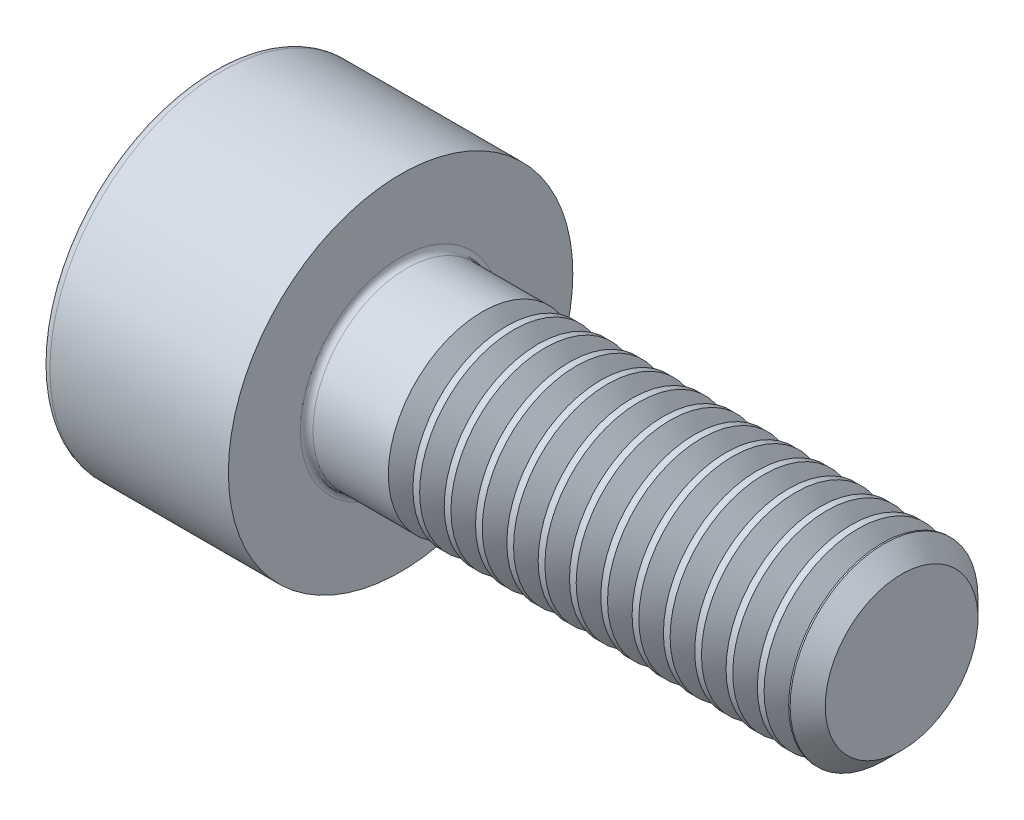
ISO-10303-21;
HEADER;
FILE_DESCRIPTION(('STEP AP214'),'2;1');
FILE_NAME('part.step','',(''),(''),'','','');
FILE_SCHEMA(('AUTOMOTIVE_DESIGN { 1 0 10303 214 1 1 1 1 }'));
ENDSEC;
DATA;
#1=APPLICATION_CONTEXT('core data for automotive mechanical design processes');
#2=APPLICATION_PROTOCOL_DEFINITION('international standard','automotive_design',2000,#1);
#3=PRODUCT_CONTEXT('',#1,'mechanical');
#4=PRODUCT('Part','Part','',(#3));
#5=PRODUCT_RELATED_PRODUCT_CATEGORY('part','',(#4));
#6=PRODUCT_DEFINITION_FORMATION('','',#4);
#7=PRODUCT_DEFINITION_CONTEXT('part definition',#1,'design');
#8=PRODUCT_DEFINITION('design','',#6,#7);
#9=PRODUCT_DEFINITION_SHAPE('','',#8);
#10=(LENGTH_UNIT() NAMED_UNIT(*) SI_UNIT(.MILLI.,.METRE.));
#11=(NAMED_UNIT(*) PLANE_ANGLE_UNIT() SI_UNIT($,.RADIAN.));
#12=(NAMED_UNIT(*) SI_UNIT($,.STERADIAN.) SOLID_ANGLE_UNIT());
#13=UNCERTAINTY_MEASURE_WITH_UNIT(LENGTH_MEASURE(1.E-05),#10,'distance_accuracy_value','');
#14=(GEOMETRIC_REPRESENTATION_CONTEXT(3) GLOBAL_UNCERTAINTY_ASSIGNED_CONTEXT((#13)) GLOBAL_UNIT_ASSIGNED_CONTEXT((#10,
#11,#12)) REPRESENTATION_CONTEXT('',''));
#15=CARTESIAN_POINT('',(0.,0.,0.));
#16=DIRECTION('',(0.,0.,1.));
#17=DIRECTION('',(1.,0.,0.));
#18=AXIS2_PLACEMENT_3D('',#15,#16,#17);
#19=CARTESIAN_POINT('',(0.,0.,0.));
#20=DIRECTION('',(-1.,0.,0.));
#21=DIRECTION('',(0.,0.,1.));
#22=AXIS2_PLACEMENT_3D('',#19,#20,#21);
#23=PLANE('',#22);
#24=DIRECTION('',(0.,-0.499999999999999,0.866025403784439));
#25=VECTOR('',#24,1.);
#26=CARTESIAN_POINT('',(0.,1.47801668912544,0.));
#27=LINE('',#26,#25);
#28=CARTESIAN_POINT('',(0.,1.47801668912544,0.));
#29=VERTEX_POINT('',#28);
#30=CARTESIAN_POINT('',(0.,0.73900834456272,1.28));
#31=VERTEX_POINT('',#30);
#32=EDGE_CURVE('E462',#29,#31,#27,.T.);
#33=ORIENTED_EDGE('',*,*,#32,.T.);
#34=DIRECTION('',(0.,1.,0.));
#35=VECTOR('',#34,1.);
#36=CARTESIAN_POINT('',(0.,-0.739008344562723,1.28));
#37=LINE('',#36,#35);
#38=CARTESIAN_POINT('',(0.,-0.739008344562723,1.28));
#39=VERTEX_POINT('',#38);
#40=EDGE_CURVE('E131',#39,#31,#37,.T.);
#41=ORIENTED_EDGE('',*,*,#40,.F.);
#42=DIRECTION('',(0.,-0.500000000000001,-0.866025403784438));
#43=VECTOR('',#42,1.);
#44=CARTESIAN_POINT('',(0.,-0.739008344562723,1.28));
#45=LINE('',#44,#43);
#46=CARTESIAN_POINT('',(0.,-1.47801668912545,0.));
#47=VERTEX_POINT('',#46);
#48=EDGE_CURVE('E481',#39,#47,#45,.T.);
#49=ORIENTED_EDGE('',*,*,#48,.T.);
#50=DIRECTION('',(0.,0.499999999999999,-0.866025403784439));
#51=VECTOR('',#50,1.);
#52=CARTESIAN_POINT('',(0.,-1.47801668912545,0.));
#53=LINE('',#52,#51);
#54=CARTESIAN_POINT('',(0.,-0.739008344562727,-1.28));
#55=VERTEX_POINT('',#54);
#56=EDGE_CURVE('E484',#47,#55,#53,.T.);
#57=ORIENTED_EDGE('',*,*,#56,.T.);
#58=DIRECTION('',(0.,-1.,0.));
#59=VECTOR('',#58,1.);
#60=CARTESIAN_POINT('',(0.,0.739008344562717,-1.28));
#61=LINE('',#60,#59);
#62=CARTESIAN_POINT('',(0.,0.739008344562717,-1.28));
#63=VERTEX_POINT('',#62);
#64=EDGE_CURVE('E487',#63,#55,#61,.T.);
#65=ORIENTED_EDGE('',*,*,#64,.F.);
#66=DIRECTION('',(0.,-0.500000000000001,-0.866025403784438));
#67=VECTOR('',#66,1.);
#68=CARTESIAN_POINT('',(0.,1.47801668912544,0.));
#69=LINE('',#68,#67);
#70=EDGE_CURVE('E126',#29,#63,#69,.T.);
#71=ORIENTED_EDGE('',*,*,#70,.F.);
#72=EDGE_LOOP('',(#33,#41,#49,#57,#65,#71));
#73=FACE_BOUND('',#72,.T.);
#74=CARTESIAN_POINT('',(0.,0.,0.));
#75=DIRECTION('',(-1.,0.,0.));
#76=DIRECTION('',(0.,0.,1.));
#77=AXIS2_PLACEMENT_3D('',#74,#75,#76);
#78=CIRCLE('',#77,2.6);
#79=CARTESIAN_POINT('',(0.,0.,2.6));
#80=VERTEX_POINT('',#79);
#81=EDGE_CURVE('E43',#80,#80,#78,.T.);
#82=ORIENTED_EDGE('',*,*,#81,.T.);
#83=EDGE_LOOP('',(#82));
#84=FACE_BOUND('',#83,.T.);
#85=ADVANCED_FACE('F35',(#73,#84),#23,.T.);
#86=CARTESIAN_POINT('',(-31.75,0.,0.));
#87=DIRECTION('',(-1.,0.,0.));
#88=DIRECTION('',(0.,0.,1.));
#89=AXIS2_PLACEMENT_3D('',#86,#87,#88);
#90=CYLINDRICAL_SURFACE('',#89,2.75);
#91=CARTESIAN_POINT('',(0.149999999999997,0.,0.));
#92=DIRECTION('',(-1.,0.,0.));
#93=DIRECTION('',(0.,0.,1.));
#94=AXIS2_PLACEMENT_3D('',#91,#92,#93);
#95=CIRCLE('',#94,2.75);
#96=CARTESIAN_POINT('',(0.149999999999997,0.,2.75));
#97=VERTEX_POINT('',#96);
#98=EDGE_CURVE('E11',#97,#97,#95,.F.);
#99=ORIENTED_EDGE('',*,*,#98,.T.);
#100=EDGE_LOOP('',(#99));
#101=FACE_BOUND('',#100,.T.);
#102=CARTESIAN_POINT('',(3.,0.,0.));
#103=DIRECTION('',(-1.,0.,0.));
#104=DIRECTION('',(0.,0.,1.));
#105=AXIS2_PLACEMENT_3D('',#102,#103,#104);
#106=CIRCLE('',#105,2.75);
#107=CARTESIAN_POINT('',(3.,0.,2.75));
#108=VERTEX_POINT('',#107);
#109=EDGE_CURVE('E149',#108,#108,#106,.T.);
#110=ORIENTED_EDGE('',*,*,#109,.T.);
#111=EDGE_LOOP('',(#110));
#112=FACE_BOUND('',#111,.T.);
#113=ADVANCED_FACE('F173',(#101,#112),#90,.T.);
#114=CARTESIAN_POINT('',(3.,2.75,0.));
#115=DIRECTION('',(1.,0.,0.));
#116=DIRECTION('',(0.,0.,-1.));
#117=AXIS2_PLACEMENT_3D('',#114,#115,#116);
#118=PLANE('',#117);
#119=CARTESIAN_POINT('',(3.,0.,0.));
#120=DIRECTION('',(1.,0.,0.));
#121=DIRECTION('',(0.,0.,-1.));
#122=AXIS2_PLACEMENT_3D('',#119,#120,#121);
#123=CIRCLE('',#122,1.59999999999997);
#124=CARTESIAN_POINT('',(3.,0.,-1.59999999999997));
#125=VERTEX_POINT('',#124);
#126=EDGE_CURVE('E152',#125,#125,#123,.F.);
#127=ORIENTED_EDGE('',*,*,#126,.T.);
#128=EDGE_LOOP('',(#127));
#129=FACE_BOUND('',#128,.T.);
#130=ORIENTED_EDGE('',*,*,#109,.F.);
#131=EDGE_LOOP('',(#130));
#132=FACE_BOUND('',#131,.T.);
#133=ADVANCED_FACE('F179',(#129,#132),#118,.T.);
#134=CARTESIAN_POINT('',(-31.75,0.,0.));
#135=DIRECTION('',(-1.,0.,0.));
#136=DIRECTION('',(0.,0.,1.));
#137=AXIS2_PLACEMENT_3D('',#134,#135,#136);
#138=CYLINDRICAL_SURFACE('',#137,1.49999999999997);
#139=CARTESIAN_POINT('',(4.30359178553217,0.,0.));
#140=DIRECTION('',(-1.,0.,0.));
#141=DIRECTION('',(0.,-1.,0.));
#142=AXIS2_PLACEMENT_3D('',#139,#140,#141);
#143=CIRCLE('',#142,1.5);
#144=CARTESIAN_POINT('',(4.30359178553217,-1.5,0.));
#145=VERTEX_POINT('',#144);
#146=EDGE_CURVE('E457',#145,#145,#143,.T.);
#147=ORIENTED_EDGE('',*,*,#146,.T.);
#148=EDGE_LOOP('',(#147));
#149=FACE_BOUND('',#148,.T.);
#150=CARTESIAN_POINT('',(3.1,0.,0.));
#151=DIRECTION('',(1.,0.,0.));
#152=DIRECTION('',(0.,0.,-1.));
#153=AXIS2_PLACEMENT_3D('',#150,#151,#152);
#154=CIRCLE('',#153,1.49999999999997);
#155=CARTESIAN_POINT('',(3.1,0.,-1.49999999999997));
#156=VERTEX_POINT('',#155);
#157=EDGE_CURVE('E155',#156,#156,#154,.T.);
#158=ORIENTED_EDGE('',*,*,#157,.T.);
#159=EDGE_LOOP('',(#158));
#160=FACE_BOUND('',#159,.T.);
#161=ADVANCED_FACE('F169',(#149,#160),#138,.T.);
#162=CARTESIAN_POINT('',(3.1,0.,0.));
#163=DIRECTION('',(1.,0.,0.));
#164=DIRECTION('',(0.,0.,-1.));
#165=AXIS2_PLACEMENT_3D('',#162,#163,#164);
#166=TOROIDAL_SURFACE('',#165,1.59999999999997,0.1);
#167=ORIENTED_EDGE('',*,*,#157,.F.);
#168=EDGE_LOOP('',(#167));
#169=FACE_BOUND('',#168,.T.);
#170=ORIENTED_EDGE('',*,*,#126,.F.);
#171=EDGE_LOOP('',(#170));
#172=FACE_BOUND('',#171,.T.);
#173=ADVANCED_FACE('F162',(#169,#172),#166,.F.);
#174=CARTESIAN_POINT('',(0.149999999999997,0.,0.));
#175=DIRECTION('',(-1.,0.,0.));
#176=DIRECTION('',(0.,0.,1.));
#177=AXIS2_PLACEMENT_3D('',#174,#175,#176);
#178=TOROIDAL_SURFACE('',#177,2.6,0.15);
#179=ORIENTED_EDGE('',*,*,#98,.F.);
#180=EDGE_LOOP('',(#179));
#181=FACE_BOUND('',#180,.T.);
#182=ORIENTED_EDGE('',*,*,#81,.F.);
#183=EDGE_LOOP('',(#182));
#184=FACE_BOUND('',#183,.T.);
#185=ADVANCED_FACE('F37',(#181,#184),#178,.T.);
#186=CARTESIAN_POINT('',(1.3,1.47801668912544,0.));
#187=DIRECTION('',(0.,-0.866025403784439,-0.499999999999999));
#188=DIRECTION('',(0.,0.499999999999999,-0.866025403784439));
#189=AXIS2_PLACEMENT_3D('',#186,#187,#188);
#190=PLANE('',#189);
#191=ORIENTED_EDGE('',*,*,#32,.F.);
#192=DIRECTION('',(-1.,0.,0.));
#193=VECTOR('',#192,1.);
#194=CARTESIAN_POINT('',(1.3,1.47801668912544,0.));
#195=LINE('',#194,#193);
#196=CARTESIAN_POINT('',(1.3,1.47801668912544,0.));
#197=VERTEX_POINT('',#196);
#198=EDGE_CURVE('E478',#197,#29,#195,.T.);
#199=ORIENTED_EDGE('',*,*,#198,.F.);
#200=DIRECTION('',(0.,-0.499999999999999,0.866025403784439));
#201=VECTOR('',#200,1.);
#202=CARTESIAN_POINT('',(1.3,1.47801668912544,0.));
#203=LINE('',#202,#201);
#204=CARTESIAN_POINT('',(1.3,1.10851251684408,0.639999999999997));
#205=VERTEX_POINT('',#204);
#206=EDGE_CURVE('E118',#197,#205,#203,.T.);
#207=ORIENTED_EDGE('',*,*,#206,.T.);
#208=CARTESIAN_POINT('',(1.3,0.73900834456272,1.28));
#209=VERTEX_POINT('',#208);
#210=EDGE_CURVE('E109',#205,#209,#203,.T.);
#211=ORIENTED_EDGE('',*,*,#210,.T.);
#212=DIRECTION('',(-1.,0.,0.));
#213=VECTOR('',#212,1.);
#214=CARTESIAN_POINT('',(1.3,0.73900834456272,1.28));
#215=LINE('',#214,#213);
#216=EDGE_CURVE('E123',#209,#31,#215,.T.);
#217=ORIENTED_EDGE('',*,*,#216,.T.);
#218=EDGE_LOOP('',(#191,#199,#207,#211,#217));
#219=FACE_BOUND('',#218,.T.);
#220=ADVANCED_FACE('F122',(#219),#190,.T.);
#221=CARTESIAN_POINT('',(1.3,-0.739008344562723,1.28));
#222=DIRECTION('',(0.,0.,1.));
#223=DIRECTION('',(0.,-1.,0.));
#224=AXIS2_PLACEMENT_3D('',#221,#222,#223);
#225=PLANE('',#224);
#226=ORIENTED_EDGE('',*,*,#40,.T.);
#227=ORIENTED_EDGE('',*,*,#216,.F.);
#228=DIRECTION('',(0.,1.,0.));
#229=VECTOR('',#228,1.);
#230=CARTESIAN_POINT('',(1.3,-0.739008344562723,1.28));
#231=LINE('',#230,#229);
#232=CARTESIAN_POINT('',(1.3,0.,1.28));
#233=VERTEX_POINT('',#232);
#234=EDGE_CURVE('E106',#233,#209,#231,.T.);
#235=ORIENTED_EDGE('',*,*,#234,.F.);
#236=CARTESIAN_POINT('',(1.3,-0.739008344562723,1.28));
#237=VERTEX_POINT('',#236);
#238=EDGE_CURVE('E117',#237,#233,#231,.T.);
#239=ORIENTED_EDGE('',*,*,#238,.F.);
#240=DIRECTION('',(-1.,0.,0.));
#241=VECTOR('',#240,1.);
#242=CARTESIAN_POINT('',(1.3,-0.739008344562723,1.28));
#243=LINE('',#242,#241);
#244=EDGE_CURVE('E133',#237,#39,#243,.T.);
#245=ORIENTED_EDGE('',*,*,#244,.T.);
#246=EDGE_LOOP('',(#226,#227,#235,#239,#245));
#247=FACE_BOUND('',#246,.T.);
#248=ADVANCED_FACE('F128',(#247),#225,.F.);
#249=CARTESIAN_POINT('',(1.3,-0.739008344562723,1.28));
#250=DIRECTION('',(0.,0.866025403784438,-0.500000000000001));
#251=DIRECTION('',(0.,0.500000000000001,0.866025403784438));
#252=AXIS2_PLACEMENT_3D('',#249,#250,#251);
#253=PLANE('',#252);
#254=ORIENTED_EDGE('',*,*,#48,.F.);
#255=ORIENTED_EDGE('',*,*,#244,.F.);
#256=DIRECTION('',(0.,-0.500000000000001,-0.866025403784438));
#257=VECTOR('',#256,1.);
#258=CARTESIAN_POINT('',(1.3,-0.739008344562723,1.28));
#259=LINE('',#258,#257);
#260=CARTESIAN_POINT('',(1.3,-1.10851251684408,0.640000000000002));
#261=VERTEX_POINT('',#260);
#262=EDGE_CURVE('E465',#237,#261,#259,.T.);
#263=ORIENTED_EDGE('',*,*,#262,.T.);
#264=CARTESIAN_POINT('',(1.3,-1.47801668912545,0.));
#265=VERTEX_POINT('',#264);
#266=EDGE_CURVE('E464',#261,#265,#259,.T.);
#267=ORIENTED_EDGE('',*,*,#266,.T.);
#268=DIRECTION('',(-1.,0.,0.));
#269=VECTOR('',#268,1.);
#270=CARTESIAN_POINT('',(1.3,-1.47801668912545,0.));
#271=LINE('',#270,#269);
#272=EDGE_CURVE('E138',#265,#47,#271,.T.);
#273=ORIENTED_EDGE('',*,*,#272,.T.);
#274=EDGE_LOOP('',(#254,#255,#263,#267,#273));
#275=FACE_BOUND('',#274,.T.);
#276=ADVANCED_FACE('F207',(#275),#253,.T.);
#277=CARTESIAN_POINT('',(1.3,-1.47801668912545,0.));
#278=DIRECTION('',(0.,0.866025403784439,0.499999999999999));
#279=DIRECTION('',(0.,-0.499999999999999,0.866025403784439));
#280=AXIS2_PLACEMENT_3D('',#277,#278,#279);
#281=PLANE('',#280);
#282=ORIENTED_EDGE('',*,*,#56,.F.);
#283=ORIENTED_EDGE('',*,*,#272,.F.);
#284=DIRECTION('',(0.,0.499999999999999,-0.866025403784439));
#285=VECTOR('',#284,1.);
#286=CARTESIAN_POINT('',(1.3,-1.47801668912545,0.));
#287=LINE('',#286,#285);
#288=CARTESIAN_POINT('',(1.3,-1.10851251684409,-0.640000000000001));
#289=VERTEX_POINT('',#288);
#290=EDGE_CURVE('E469',#265,#289,#287,.T.);
#291=ORIENTED_EDGE('',*,*,#290,.T.);
#292=CARTESIAN_POINT('',(1.3,-0.739008344562727,-1.28));
#293=VERTEX_POINT('',#292);
#294=EDGE_CURVE('E468',#289,#293,#287,.T.);
#295=ORIENTED_EDGE('',*,*,#294,.T.);
#296=DIRECTION('',(-1.,0.,0.));
#297=VECTOR('',#296,1.);
#298=CARTESIAN_POINT('',(1.3,-0.739008344562727,-1.28));
#299=LINE('',#298,#297);
#300=EDGE_CURVE('E496',#293,#55,#299,.T.);
#301=ORIENTED_EDGE('',*,*,#300,.T.);
#302=EDGE_LOOP('',(#282,#283,#291,#295,#301));
#303=FACE_BOUND('',#302,.T.);
#304=ADVANCED_FACE('F210',(#303),#281,.T.);
#305=CARTESIAN_POINT('',(1.3,0.739008344562717,-1.28));
#306=DIRECTION('',(0.,0.,-1.));
#307=DIRECTION('',(0.,1.,0.));
#308=AXIS2_PLACEMENT_3D('',#305,#306,#307);
#309=PLANE('',#308);
#310=ORIENTED_EDGE('',*,*,#64,.T.);
#311=ORIENTED_EDGE('',*,*,#300,.F.);
#312=DIRECTION('',(0.,-1.,0.));
#313=VECTOR('',#312,1.);
#314=CARTESIAN_POINT('',(1.3,0.739008344562717,-1.28));
#315=LINE('',#314,#313);
#316=CARTESIAN_POINT('',(1.3,0.,-1.28));
#317=VERTEX_POINT('',#316);
#318=EDGE_CURVE('E472',#317,#293,#315,.T.);
#319=ORIENTED_EDGE('',*,*,#318,.F.);
#320=CARTESIAN_POINT('',(1.3,0.739008344562717,-1.28));
#321=VERTEX_POINT('',#320);
#322=EDGE_CURVE('E50',#321,#317,#315,.T.);
#323=ORIENTED_EDGE('',*,*,#322,.F.);
#324=DIRECTION('',(-1.,0.,0.));
#325=VECTOR('',#324,1.);
#326=CARTESIAN_POINT('',(1.3,0.739008344562717,-1.28));
#327=LINE('',#326,#325);
#328=EDGE_CURVE('E493',#321,#63,#327,.T.);
#329=ORIENTED_EDGE('',*,*,#328,.T.);
#330=EDGE_LOOP('',(#310,#311,#319,#323,#329));
#331=FACE_BOUND('',#330,.T.);
#332=ADVANCED_FACE('F214',(#331),#309,.F.);
#333=CARTESIAN_POINT('',(1.3,1.47801668912544,0.));
#334=DIRECTION('',(0.,0.866025403784438,-0.500000000000001));
#335=DIRECTION('',(0.,0.500000000000001,0.866025403784438));
#336=AXIS2_PLACEMENT_3D('',#333,#334,#335);
#337=PLANE('',#336);
#338=ORIENTED_EDGE('',*,*,#70,.T.);
#339=ORIENTED_EDGE('',*,*,#328,.F.);
#340=DIRECTION('',(0.,-0.500000000000001,-0.866025403784438));
#341=VECTOR('',#340,1.);
#342=CARTESIAN_POINT('',(1.3,1.47801668912544,0.));
#343=LINE('',#342,#341);
#344=CARTESIAN_POINT('',(1.3,1.10851251684408,-0.640000000000001));
#345=VERTEX_POINT('',#344);
#346=EDGE_CURVE('E474',#345,#321,#343,.T.);
#347=ORIENTED_EDGE('',*,*,#346,.F.);
#348=EDGE_CURVE('E475',#197,#345,#343,.T.);
#349=ORIENTED_EDGE('',*,*,#348,.F.);
#350=ORIENTED_EDGE('',*,*,#198,.T.);
#351=EDGE_LOOP('',(#338,#339,#347,#349,#350));
#352=FACE_BOUND('',#351,.T.);
#353=ADVANCED_FACE('F218',(#352),#337,.F.);
#354=CARTESIAN_POINT('',(1.3,1.47801668912544,0.));
#355=DIRECTION('',(1.,0.,0.));
#356=DIRECTION('',(0.,0.,-1.));
#357=AXIS2_PLACEMENT_3D('',#354,#355,#356);
#358=PLANE('',#357);
#359=ORIENTED_EDGE('',*,*,#318,.T.);
#360=ORIENTED_EDGE('',*,*,#294,.F.);
#361=CARTESIAN_POINT('',(1.3,0.,0.));
#362=DIRECTION('',(-1.,0.,0.));
#363=DIRECTION('',(0.,0.,1.));
#364=AXIS2_PLACEMENT_3D('',#361,#362,#363);
#365=CIRCLE('',#364,1.28);
#366=EDGE_CURVE('E513',#317,#289,#365,.T.);
#367=ORIENTED_EDGE('',*,*,#366,.F.);
#368=EDGE_LOOP('',(#359,#360,#367));
#369=FACE_BOUND('',#368,.T.);
#370=ADVANCED_FACE('F222',(#369),#358,.F.);
#371=ORIENTED_EDGE('',*,*,#290,.F.);
#372=ORIENTED_EDGE('',*,*,#266,.F.);
#373=EDGE_CURVE('E136',#289,#261,#365,.T.);
#374=ORIENTED_EDGE('',*,*,#373,.F.);
#375=EDGE_LOOP('',(#371,#372,#374));
#376=FACE_BOUND('',#375,.T.);
#377=ADVANCED_FACE('F226',(#376),#358,.F.);
#378=ORIENTED_EDGE('',*,*,#262,.F.);
#379=ORIENTED_EDGE('',*,*,#238,.T.);
#380=EDGE_CURVE('E132',#261,#233,#365,.T.);
#381=ORIENTED_EDGE('',*,*,#380,.F.);
#382=EDGE_LOOP('',(#378,#379,#381));
#383=FACE_BOUND('',#382,.T.);
#384=ADVANCED_FACE('F522',(#383),#358,.F.);
#385=ORIENTED_EDGE('',*,*,#234,.T.);
#386=ORIENTED_EDGE('',*,*,#210,.F.);
#387=EDGE_CURVE('E112',#233,#205,#365,.T.);
#388=ORIENTED_EDGE('',*,*,#387,.F.);
#389=EDGE_LOOP('',(#385,#386,#388));
#390=FACE_BOUND('',#389,.T.);
#391=ADVANCED_FACE('F108',(#390),#358,.F.);
#392=ORIENTED_EDGE('',*,*,#206,.F.);
#393=ORIENTED_EDGE('',*,*,#348,.T.);
#394=EDGE_CURVE('E143',#205,#345,#365,.T.);
#395=ORIENTED_EDGE('',*,*,#394,.F.);
#396=EDGE_LOOP('',(#392,#393,#395));
#397=FACE_BOUND('',#396,.T.);
#398=ADVANCED_FACE('F508',(#397),#358,.F.);
#399=ORIENTED_EDGE('',*,*,#346,.T.);
#400=ORIENTED_EDGE('',*,*,#322,.T.);
#401=EDGE_CURVE('E512',#345,#317,#365,.T.);
#402=ORIENTED_EDGE('',*,*,#401,.F.);
#403=EDGE_LOOP('',(#399,#400,#402));
#404=FACE_BOUND('',#403,.T.);
#405=ADVANCED_FACE('F203',(#404),#358,.F.);
#406=CARTESIAN_POINT('',(1.3,0.,0.));
#407=DIRECTION('',(-1.,0.,0.));
#408=DIRECTION('',(0.,0.,1.));
#409=AXIS2_PLACEMENT_3D('',#406,#407,#408);
#410=CONICAL_SURFACE('',#409,1.28,1.04719755119659);
#411=CARTESIAN_POINT('',(2.03900834456273,0.,0.));
#412=VERTEX_POINT('',#411);
#413=VERTEX_LOOP('',#412);
#414=FACE_BOUND('',#413,.T.);
#415=ORIENTED_EDGE('',*,*,#387,.T.);
#416=ORIENTED_EDGE('',*,*,#394,.T.);
#417=ORIENTED_EDGE('',*,*,#401,.T.);
#418=ORIENTED_EDGE('',*,*,#366,.T.);
#419=ORIENTED_EDGE('',*,*,#373,.T.);
#420=ORIENTED_EDGE('',*,*,#380,.T.);
#421=EDGE_LOOP('',(#415,#416,#417,#418,#419,#420));
#422=FACE_BOUND('',#421,.T.);
#423=ADVANCED_FACE('F200',(#414,#422),#410,.F.);
#424=CARTESIAN_POINT('',(4.69640821446782,0.,0.));
#425=DIRECTION('',(1.,0.,0.));
#426=DIRECTION('',(0.,1.,0.));
#427=AXIS2_PLACEMENT_3D('',#424,#425,#426);
#428=CONICAL_SURFACE('',#427,1.5,0.959931088596882);
#429=CARTESIAN_POINT('',(4.5,0.,0.));
#430=DIRECTION('',(-1.,0.,0.));
#431=DIRECTION('',(0.,-1.,0.));
#432=AXIS2_PLACEMENT_3D('',#429,#430,#431);
#433=CIRCLE('',#432,1.2195);
#434=CARTESIAN_POINT('',(4.5,-1.2195,0.));
#435=VERTEX_POINT('',#434);
#436=EDGE_CURVE('E454',#435,#435,#433,.T.);
#437=ORIENTED_EDGE('',*,*,#436,.F.);
#438=EDGE_LOOP('',(#437));
#439=FACE_BOUND('',#438,.T.);
#440=CARTESIAN_POINT('',(4.69640821446782,0.,0.));
#441=DIRECTION('',(-1.,0.,0.));
#442=DIRECTION('',(0.,-1.,0.));
#443=AXIS2_PLACEMENT_3D('',#440,#441,#442);
#444=CIRCLE('',#443,1.5);
#445=CARTESIAN_POINT('',(4.69640821446782,-1.5,0.));
#446=VERTEX_POINT('',#445);
#447=EDGE_CURVE('E460',#446,#446,#444,.T.);
#448=ORIENTED_EDGE('',*,*,#447,.T.);
#449=EDGE_LOOP('',(#448));
#450=FACE_BOUND('',#449,.T.);
#451=ADVANCED_FACE('F202',(#439,#450),#428,.T.);
#452=CARTESIAN_POINT('',(4.5,0.,0.));
#453=DIRECTION('',(-1.,0.,0.));
#454=DIRECTION('',(0.,-1.,0.));
#455=AXIS2_PLACEMENT_3D('',#452,#453,#454);
#456=CONICAL_SURFACE('',#455,1.2195,0.959931088596876);
#457=ORIENTED_EDGE('',*,*,#146,.F.);
#458=EDGE_LOOP('',(#457));
#459=FACE_BOUND('',#458,.T.);
#460=ORIENTED_EDGE('',*,*,#436,.T.);
#461=EDGE_LOOP('',(#460));
#462=FACE_BOUND('',#461,.T.);
#463=ADVANCED_FACE('F230',(#459,#462),#456,.T.);
#464=CARTESIAN_POINT('',(4.80359178553217,0.,0.));
#465=DIRECTION('',(-1.,0.,0.));
#466=DIRECTION('',(0.,-1.,0.));
#467=AXIS2_PLACEMENT_3D('',#464,#465,#466);
#468=CIRCLE('',#467,1.5);
#469=CARTESIAN_POINT('',(4.80359178553217,-1.5,0.));
#470=VERTEX_POINT('',#469);
#471=EDGE_CURVE('E448',#470,#470,#468,.T.);
#472=ORIENTED_EDGE('',*,*,#471,.T.);
#473=EDGE_LOOP('',(#472));
#474=FACE_BOUND('',#473,.T.);
#475=ORIENTED_EDGE('',*,*,#447,.F.);
#476=EDGE_LOOP('',(#475));
#477=FACE_BOUND('',#476,.T.);
#478=ADVANCED_FACE('F190',(#474,#477),#138,.T.);
#479=CARTESIAN_POINT('',(5.19640821446782,0.,0.));
#480=DIRECTION('',(1.,0.,0.));
#481=DIRECTION('',(0.,1.,0.));
#482=AXIS2_PLACEMENT_3D('',#479,#480,#481);
#483=CONICAL_SURFACE('',#482,1.5,0.959931088596882);
#484=CARTESIAN_POINT('',(5.,0.,0.));
#485=DIRECTION('',(-1.,0.,0.));
#486=DIRECTION('',(0.,-1.,0.));
#487=AXIS2_PLACEMENT_3D('',#484,#485,#486);
#488=CIRCLE('',#487,1.2195);
#489=CARTESIAN_POINT('',(5.,-1.2195,0.));
#490=VERTEX_POINT('',#489);
#491=EDGE_CURVE('E445',#490,#490,#488,.T.);
#492=ORIENTED_EDGE('',*,*,#491,.F.);
#493=EDGE_LOOP('',(#492));
#494=FACE_BOUND('',#493,.T.);
#495=CARTESIAN_POINT('',(5.19640821446782,0.,0.));
#496=DIRECTION('',(-1.,0.,0.));
#497=DIRECTION('',(0.,-1.,0.));
#498=AXIS2_PLACEMENT_3D('',#495,#496,#497);
#499=CIRCLE('',#498,1.5);
#500=CARTESIAN_POINT('',(5.19640821446782,-1.5,0.));
#501=VERTEX_POINT('',#500);
#502=EDGE_CURVE('E451',#501,#501,#499,.T.);
#503=ORIENTED_EDGE('',*,*,#502,.T.);
#504=EDGE_LOOP('',(#503));
#505=FACE_BOUND('',#504,.T.);
#506=ADVANCED_FACE('F235',(#494,#505),#483,.T.);
#507=CARTESIAN_POINT('',(5.,0.,0.));
#508=DIRECTION('',(-1.,0.,0.));
#509=DIRECTION('',(0.,-1.,0.));
#510=AXIS2_PLACEMENT_3D('',#507,#508,#509);
#511=CONICAL_SURFACE('',#510,1.2195,0.959931088596876);
#512=ORIENTED_EDGE('',*,*,#471,.F.);
#513=EDGE_LOOP('',(#512));
#514=FACE_BOUND('',#513,.T.);
#515=ORIENTED_EDGE('',*,*,#491,.T.);
#516=EDGE_LOOP('',(#515));
#517=FACE_BOUND('',#516,.T.);
#518=ADVANCED_FACE('F238',(#514,#517),#511,.T.);
#519=CARTESIAN_POINT('',(5.30359178553217,0.,0.));
#520=DIRECTION('',(-1.,0.,0.));
#521=DIRECTION('',(0.,-1.,0.));
#522=AXIS2_PLACEMENT_3D('',#519,#520,#521);
#523=CIRCLE('',#522,1.5);
#524=CARTESIAN_POINT('',(5.30359178553217,-1.5,0.));
#525=VERTEX_POINT('',#524);
#526=EDGE_CURVE('E439',#525,#525,#523,.T.);
#527=ORIENTED_EDGE('',*,*,#526,.T.);
#528=EDGE_LOOP('',(#527));
#529=FACE_BOUND('',#528,.T.);
#530=ORIENTED_EDGE('',*,*,#502,.F.);
#531=EDGE_LOOP('',(#530));
#532=FACE_BOUND('',#531,.T.);
#533=ADVANCED_FACE('F242',(#529,#532),#138,.T.);
#534=CARTESIAN_POINT('',(5.69640821446782,0.,0.));
#535=DIRECTION('',(1.,0.,0.));
#536=DIRECTION('',(0.,1.,0.));
#537=AXIS2_PLACEMENT_3D('',#534,#535,#536);
#538=CONICAL_SURFACE('',#537,1.5,0.959931088596882);
#539=CARTESIAN_POINT('',(5.5,0.,0.));
#540=DIRECTION('',(-1.,0.,0.));
#541=DIRECTION('',(0.,-1.,0.));
#542=AXIS2_PLACEMENT_3D('',#539,#540,#541);
#543=CIRCLE('',#542,1.2195);
#544=CARTESIAN_POINT('',(5.5,-1.2195,0.));
#545=VERTEX_POINT('',#544);
#546=EDGE_CURVE('E436',#545,#545,#543,.T.);
#547=ORIENTED_EDGE('',*,*,#546,.F.);
#548=EDGE_LOOP('',(#547));
#549=FACE_BOUND('',#548,.T.);
#550=CARTESIAN_POINT('',(5.69640821446782,0.,0.));
#551=DIRECTION('',(-1.,0.,0.));
#552=DIRECTION('',(0.,-1.,0.));
#553=AXIS2_PLACEMENT_3D('',#550,#551,#552);
#554=CIRCLE('',#553,1.5);
#555=CARTESIAN_POINT('',(5.69640821446782,-1.5,0.));
#556=VERTEX_POINT('',#555);
#557=EDGE_CURVE('E442',#556,#556,#554,.T.);
#558=ORIENTED_EDGE('',*,*,#557,.T.);
#559=EDGE_LOOP('',(#558));
#560=FACE_BOUND('',#559,.T.);
#561=ADVANCED_FACE('F244',(#549,#560),#538,.T.);
#562=CARTESIAN_POINT('',(5.5,0.,0.));
#563=DIRECTION('',(-1.,0.,0.));
#564=DIRECTION('',(0.,-1.,0.));
#565=AXIS2_PLACEMENT_3D('',#562,#563,#564);
#566=CONICAL_SURFACE('',#565,1.2195,0.959931088596876);
#567=ORIENTED_EDGE('',*,*,#526,.F.);
#568=EDGE_LOOP('',(#567));
#569=FACE_BOUND('',#568,.T.);
#570=ORIENTED_EDGE('',*,*,#546,.T.);
#571=EDGE_LOOP('',(#570));
#572=FACE_BOUND('',#571,.T.);
#573=ADVANCED_FACE('F247',(#569,#572),#566,.T.);
#574=CARTESIAN_POINT('',(5.80359178553217,0.,0.));
#575=DIRECTION('',(-1.,0.,0.));
#576=DIRECTION('',(0.,-1.,0.));
#577=AXIS2_PLACEMENT_3D('',#574,#575,#576);
#578=CIRCLE('',#577,1.5);
#579=CARTESIAN_POINT('',(5.80359178553217,-1.5,0.));
#580=VERTEX_POINT('',#579);
#581=EDGE_CURVE('E430',#580,#580,#578,.T.);
#582=ORIENTED_EDGE('',*,*,#581,.T.);
#583=EDGE_LOOP('',(#582));
#584=FACE_BOUND('',#583,.T.);
#585=ORIENTED_EDGE('',*,*,#557,.F.);
#586=EDGE_LOOP('',(#585));
#587=FACE_BOUND('',#586,.T.);
#588=ADVANCED_FACE('F251',(#584,#587),#138,.T.);
#589=CARTESIAN_POINT('',(6.19640821446782,0.,0.));
#590=DIRECTION('',(1.,0.,0.));
#591=DIRECTION('',(0.,1.,0.));
#592=AXIS2_PLACEMENT_3D('',#589,#590,#591);
#593=CONICAL_SURFACE('',#592,1.5,0.959931088596882);
#594=CARTESIAN_POINT('',(6.,0.,0.));
#595=DIRECTION('',(-1.,0.,0.));
#596=DIRECTION('',(0.,-1.,0.));
#597=AXIS2_PLACEMENT_3D('',#594,#595,#596);
#598=CIRCLE('',#597,1.2195);
#599=CARTESIAN_POINT('',(6.,-1.2195,0.));
#600=VERTEX_POINT('',#599);
#601=EDGE_CURVE('E427',#600,#600,#598,.T.);
#602=ORIENTED_EDGE('',*,*,#601,.F.);
#603=EDGE_LOOP('',(#602));
#604=FACE_BOUND('',#603,.T.);
#605=CARTESIAN_POINT('',(6.19640821446782,0.,0.));
#606=DIRECTION('',(-1.,0.,0.));
#607=DIRECTION('',(0.,-1.,0.));
#608=AXIS2_PLACEMENT_3D('',#605,#606,#607);
#609=CIRCLE('',#608,1.5);
#610=CARTESIAN_POINT('',(6.19640821446782,-1.5,0.));
#611=VERTEX_POINT('',#610);
#612=EDGE_CURVE('E433',#611,#611,#609,.T.);
#613=ORIENTED_EDGE('',*,*,#612,.T.);
#614=EDGE_LOOP('',(#613));
#615=FACE_BOUND('',#614,.T.);
#616=ADVANCED_FACE('F253',(#604,#615),#593,.T.);
#617=CARTESIAN_POINT('',(6.,0.,0.));
#618=DIRECTION('',(-1.,0.,0.));
#619=DIRECTION('',(0.,-1.,0.));
#620=AXIS2_PLACEMENT_3D('',#617,#618,#619);
#621=CONICAL_SURFACE('',#620,1.2195,0.959931088596876);
#622=ORIENTED_EDGE('',*,*,#581,.F.);
#623=EDGE_LOOP('',(#622));
#624=FACE_BOUND('',#623,.T.);
#625=ORIENTED_EDGE('',*,*,#601,.T.);
#626=EDGE_LOOP('',(#625));
#627=FACE_BOUND('',#626,.T.);
#628=ADVANCED_FACE('F256',(#624,#627),#621,.T.);
#629=CARTESIAN_POINT('',(6.30359178553217,0.,0.));
#630=DIRECTION('',(-1.,0.,0.));
#631=DIRECTION('',(0.,-1.,0.));
#632=AXIS2_PLACEMENT_3D('',#629,#630,#631);
#633=CIRCLE('',#632,1.5);
#634=CARTESIAN_POINT('',(6.30359178553217,-1.5,0.));
#635=VERTEX_POINT('',#634);
#636=EDGE_CURVE('E421',#635,#635,#633,.T.);
#637=ORIENTED_EDGE('',*,*,#636,.T.);
#638=EDGE_LOOP('',(#637));
#639=FACE_BOUND('',#638,.T.);
#640=ORIENTED_EDGE('',*,*,#612,.F.);
#641=EDGE_LOOP('',(#640));
#642=FACE_BOUND('',#641,.T.);
#643=ADVANCED_FACE('F260',(#639,#642),#138,.T.);
#644=CARTESIAN_POINT('',(6.69640821446782,0.,0.));
#645=DIRECTION('',(1.,0.,0.));
#646=DIRECTION('',(0.,1.,0.));
#647=AXIS2_PLACEMENT_3D('',#644,#645,#646);
#648=CONICAL_SURFACE('',#647,1.5,0.959931088596882);
#649=CARTESIAN_POINT('',(6.5,0.,0.));
#650=DIRECTION('',(-1.,0.,0.));
#651=DIRECTION('',(0.,-1.,0.));
#652=AXIS2_PLACEMENT_3D('',#649,#650,#651);
#653=CIRCLE('',#652,1.2195);
#654=CARTESIAN_POINT('',(6.5,-1.2195,0.));
#655=VERTEX_POINT('',#654);
#656=EDGE_CURVE('E418',#655,#655,#653,.T.);
#657=ORIENTED_EDGE('',*,*,#656,.F.);
#658=EDGE_LOOP('',(#657));
#659=FACE_BOUND('',#658,.T.);
#660=CARTESIAN_POINT('',(6.69640821446782,0.,0.));
#661=DIRECTION('',(-1.,0.,0.));
#662=DIRECTION('',(0.,-1.,0.));
#663=AXIS2_PLACEMENT_3D('',#660,#661,#662);
#664=CIRCLE('',#663,1.5);
#665=CARTESIAN_POINT('',(6.69640821446782,-1.5,0.));
#666=VERTEX_POINT('',#665);
#667=EDGE_CURVE('E424',#666,#666,#664,.T.);
#668=ORIENTED_EDGE('',*,*,#667,.T.);
#669=EDGE_LOOP('',(#668));
#670=FACE_BOUND('',#669,.T.);
#671=ADVANCED_FACE('F262',(#659,#670),#648,.T.);
#672=CARTESIAN_POINT('',(6.5,0.,0.));
#673=DIRECTION('',(-1.,0.,0.));
#674=DIRECTION('',(0.,-1.,0.));
#675=AXIS2_PLACEMENT_3D('',#672,#673,#674);
#676=CONICAL_SURFACE('',#675,1.2195,0.959931088596876);
#677=ORIENTED_EDGE('',*,*,#636,.F.);
#678=EDGE_LOOP('',(#677));
#679=FACE_BOUND('',#678,.T.);
#680=ORIENTED_EDGE('',*,*,#656,.T.);
#681=EDGE_LOOP('',(#680));
#682=FACE_BOUND('',#681,.T.);
#683=ADVANCED_FACE('F265',(#679,#682),#676,.T.);
#684=CARTESIAN_POINT('',(6.80359178553217,0.,0.));
#685=DIRECTION('',(-1.,0.,0.));
#686=DIRECTION('',(0.,-1.,0.));
#687=AXIS2_PLACEMENT_3D('',#684,#685,#686);
#688=CIRCLE('',#687,1.5);
#689=CARTESIAN_POINT('',(6.80359178553217,-1.5,0.));
#690=VERTEX_POINT('',#689);
#691=EDGE_CURVE('E412',#690,#690,#688,.T.);
#692=ORIENTED_EDGE('',*,*,#691,.T.);
#693=EDGE_LOOP('',(#692));
#694=FACE_BOUND('',#693,.T.);
#695=ORIENTED_EDGE('',*,*,#667,.F.);
#696=EDGE_LOOP('',(#695));
#697=FACE_BOUND('',#696,.T.);
#698=ADVANCED_FACE('F269',(#694,#697),#138,.T.);
#699=CARTESIAN_POINT('',(7.19640821446782,0.,0.));
#700=DIRECTION('',(1.,0.,0.));
#701=DIRECTION('',(0.,1.,0.));
#702=AXIS2_PLACEMENT_3D('',#699,#700,#701);
#703=CONICAL_SURFACE('',#702,1.5,0.959931088596882);
#704=CARTESIAN_POINT('',(7.,0.,0.));
#705=DIRECTION('',(-1.,0.,0.));
#706=DIRECTION('',(0.,-1.,0.));
#707=AXIS2_PLACEMENT_3D('',#704,#705,#706);
#708=CIRCLE('',#707,1.2195);
#709=CARTESIAN_POINT('',(7.,-1.2195,0.));
#710=VERTEX_POINT('',#709);
#711=EDGE_CURVE('E409',#710,#710,#708,.T.);
#712=ORIENTED_EDGE('',*,*,#711,.F.);
#713=EDGE_LOOP('',(#712));
#714=FACE_BOUND('',#713,.T.);
#715=CARTESIAN_POINT('',(7.19640821446782,0.,0.));
#716=DIRECTION('',(-1.,0.,0.));
#717=DIRECTION('',(0.,-1.,0.));
#718=AXIS2_PLACEMENT_3D('',#715,#716,#717);
#719=CIRCLE('',#718,1.5);
#720=CARTESIAN_POINT('',(7.19640821446782,-1.5,0.));
#721=VERTEX_POINT('',#720);
#722=EDGE_CURVE('E415',#721,#721,#719,.T.);
#723=ORIENTED_EDGE('',*,*,#722,.T.);
#724=EDGE_LOOP('',(#723));
#725=FACE_BOUND('',#724,.T.);
#726=ADVANCED_FACE('F271',(#714,#725),#703,.T.);
#727=CARTESIAN_POINT('',(7.,0.,0.));
#728=DIRECTION('',(-1.,0.,0.));
#729=DIRECTION('',(0.,-1.,0.));
#730=AXIS2_PLACEMENT_3D('',#727,#728,#729);
#731=CONICAL_SURFACE('',#730,1.2195,0.959931088596876);
#732=ORIENTED_EDGE('',*,*,#691,.F.);
#733=EDGE_LOOP('',(#732));
#734=FACE_BOUND('',#733,.T.);
#735=ORIENTED_EDGE('',*,*,#711,.T.);
#736=EDGE_LOOP('',(#735));
#737=FACE_BOUND('',#736,.T.);
#738=ADVANCED_FACE('F274',(#734,#737),#731,.T.);
#739=CARTESIAN_POINT('',(7.30359178553217,0.,0.));
#740=DIRECTION('',(-1.,0.,0.));
#741=DIRECTION('',(0.,-1.,0.));
#742=AXIS2_PLACEMENT_3D('',#739,#740,#741);
#743=CIRCLE('',#742,1.5);
#744=CARTESIAN_POINT('',(7.30359178553217,-1.5,0.));
#745=VERTEX_POINT('',#744);
#746=EDGE_CURVE('E403',#745,#745,#743,.T.);
#747=ORIENTED_EDGE('',*,*,#746,.T.);
#748=EDGE_LOOP('',(#747));
#749=FACE_BOUND('',#748,.T.);
#750=ORIENTED_EDGE('',*,*,#722,.F.);
#751=EDGE_LOOP('',(#750));
#752=FACE_BOUND('',#751,.T.);
#753=ADVANCED_FACE('F278',(#749,#752),#138,.T.);
#754=CARTESIAN_POINT('',(7.69640821446782,0.,0.));
#755=DIRECTION('',(1.,0.,0.));
#756=DIRECTION('',(0.,1.,0.));
#757=AXIS2_PLACEMENT_3D('',#754,#755,#756);
#758=CONICAL_SURFACE('',#757,1.5,0.959931088596882);
#759=CARTESIAN_POINT('',(7.5,0.,0.));
#760=DIRECTION('',(-1.,0.,0.));
#761=DIRECTION('',(0.,-1.,0.));
#762=AXIS2_PLACEMENT_3D('',#759,#760,#761);
#763=CIRCLE('',#762,1.2195);
#764=CARTESIAN_POINT('',(7.5,-1.2195,0.));
#765=VERTEX_POINT('',#764);
#766=EDGE_CURVE('E400',#765,#765,#763,.T.);
#767=ORIENTED_EDGE('',*,*,#766,.F.);
#768=EDGE_LOOP('',(#767));
#769=FACE_BOUND('',#768,.T.);
#770=CARTESIAN_POINT('',(7.69640821446782,0.,0.));
#771=DIRECTION('',(-1.,0.,0.));
#772=DIRECTION('',(0.,-1.,0.));
#773=AXIS2_PLACEMENT_3D('',#770,#771,#772);
#774=CIRCLE('',#773,1.5);
#775=CARTESIAN_POINT('',(7.69640821446782,-1.5,0.));
#776=VERTEX_POINT('',#775);
#777=EDGE_CURVE('E406',#776,#776,#774,.T.);
#778=ORIENTED_EDGE('',*,*,#777,.T.);
#779=EDGE_LOOP('',(#778));
#780=FACE_BOUND('',#779,.T.);
#781=ADVANCED_FACE('F280',(#769,#780),#758,.T.);
#782=CARTESIAN_POINT('',(7.5,0.,0.));
#783=DIRECTION('',(-1.,0.,0.));
#784=DIRECTION('',(0.,-1.,0.));
#785=AXIS2_PLACEMENT_3D('',#782,#783,#784);
#786=CONICAL_SURFACE('',#785,1.2195,0.959931088596876);
#787=ORIENTED_EDGE('',*,*,#746,.F.);
#788=EDGE_LOOP('',(#787));
#789=FACE_BOUND('',#788,.T.);
#790=ORIENTED_EDGE('',*,*,#766,.T.);
#791=EDGE_LOOP('',(#790));
#792=FACE_BOUND('',#791,.T.);
#793=ADVANCED_FACE('F283',(#789,#792),#786,.T.);
#794=CARTESIAN_POINT('',(7.80359178553217,0.,0.));
#795=DIRECTION('',(-1.,0.,0.));
#796=DIRECTION('',(0.,-1.,0.));
#797=AXIS2_PLACEMENT_3D('',#794,#795,#796);
#798=CIRCLE('',#797,1.5);
#799=CARTESIAN_POINT('',(7.80359178553217,-1.5,0.));
#800=VERTEX_POINT('',#799);
#801=EDGE_CURVE('E394',#800,#800,#798,.T.);
#802=ORIENTED_EDGE('',*,*,#801,.T.);
#803=EDGE_LOOP('',(#802));
#804=FACE_BOUND('',#803,.T.);
#805=ORIENTED_EDGE('',*,*,#777,.F.);
#806=EDGE_LOOP('',(#805));
#807=FACE_BOUND('',#806,.T.);
#808=ADVANCED_FACE('F287',(#804,#807),#138,.T.);
#809=CARTESIAN_POINT('',(8.19640821446782,0.,0.));
#810=DIRECTION('',(1.,0.,0.));
#811=DIRECTION('',(0.,1.,0.));
#812=AXIS2_PLACEMENT_3D('',#809,#810,#811);
#813=CONICAL_SURFACE('',#812,1.5,0.959931088596882);
#814=CARTESIAN_POINT('',(8.,0.,0.));
#815=DIRECTION('',(-1.,0.,0.));
#816=DIRECTION('',(0.,-1.,0.));
#817=AXIS2_PLACEMENT_3D('',#814,#815,#816);
#818=CIRCLE('',#817,1.2195);
#819=CARTESIAN_POINT('',(8.,-1.2195,0.));
#820=VERTEX_POINT('',#819);
#821=EDGE_CURVE('E391',#820,#820,#818,.T.);
#822=ORIENTED_EDGE('',*,*,#821,.F.);
#823=EDGE_LOOP('',(#822));
#824=FACE_BOUND('',#823,.T.);
#825=CARTESIAN_POINT('',(8.19640821446782,0.,0.));
#826=DIRECTION('',(-1.,0.,0.));
#827=DIRECTION('',(0.,-1.,0.));
#828=AXIS2_PLACEMENT_3D('',#825,#826,#827);
#829=CIRCLE('',#828,1.5);
#830=CARTESIAN_POINT('',(8.19640821446782,-1.5,0.));
#831=VERTEX_POINT('',#830);
#832=EDGE_CURVE('E397',#831,#831,#829,.T.);
#833=ORIENTED_EDGE('',*,*,#832,.T.);
#834=EDGE_LOOP('',(#833));
#835=FACE_BOUND('',#834,.T.);
#836=ADVANCED_FACE('F289',(#824,#835),#813,.T.);
#837=CARTESIAN_POINT('',(8.,0.,0.));
#838=DIRECTION('',(-1.,0.,0.));
#839=DIRECTION('',(0.,-1.,0.));
#840=AXIS2_PLACEMENT_3D('',#837,#838,#839);
#841=CONICAL_SURFACE('',#840,1.2195,0.959931088596876);
#842=ORIENTED_EDGE('',*,*,#801,.F.);
#843=EDGE_LOOP('',(#842));
#844=FACE_BOUND('',#843,.T.);
#845=ORIENTED_EDGE('',*,*,#821,.T.);
#846=EDGE_LOOP('',(#845));
#847=FACE_BOUND('',#846,.T.);
#848=ADVANCED_FACE('F292',(#844,#847),#841,.T.);
#849=CARTESIAN_POINT('',(8.30359178553217,0.,0.));
#850=DIRECTION('',(-1.,0.,0.));
#851=DIRECTION('',(0.,-1.,0.));
#852=AXIS2_PLACEMENT_3D('',#849,#850,#851);
#853=CIRCLE('',#852,1.5);
#854=CARTESIAN_POINT('',(8.30359178553217,-1.5,0.));
#855=VERTEX_POINT('',#854);
#856=EDGE_CURVE('E385',#855,#855,#853,.T.);
#857=ORIENTED_EDGE('',*,*,#856,.T.);
#858=EDGE_LOOP('',(#857));
#859=FACE_BOUND('',#858,.T.);
#860=ORIENTED_EDGE('',*,*,#832,.F.);
#861=EDGE_LOOP('',(#860));
#862=FACE_BOUND('',#861,.T.);
#863=ADVANCED_FACE('F296',(#859,#862),#138,.T.);
#864=CARTESIAN_POINT('',(8.69640821446782,0.,0.));
#865=DIRECTION('',(1.,0.,0.));
#866=DIRECTION('',(0.,1.,0.));
#867=AXIS2_PLACEMENT_3D('',#864,#865,#866);
#868=CONICAL_SURFACE('',#867,1.5,0.959931088596882);
#869=CARTESIAN_POINT('',(8.5,0.,0.));
#870=DIRECTION('',(-1.,0.,0.));
#871=DIRECTION('',(0.,-1.,0.));
#872=AXIS2_PLACEMENT_3D('',#869,#870,#871);
#873=CIRCLE('',#872,1.2195);
#874=CARTESIAN_POINT('',(8.5,-1.2195,0.));
#875=VERTEX_POINT('',#874);
#876=EDGE_CURVE('E382',#875,#875,#873,.T.);
#877=ORIENTED_EDGE('',*,*,#876,.F.);
#878=EDGE_LOOP('',(#877));
#879=FACE_BOUND('',#878,.T.);
#880=CARTESIAN_POINT('',(8.69640821446782,0.,0.));
#881=DIRECTION('',(-1.,0.,0.));
#882=DIRECTION('',(0.,-1.,0.));
#883=AXIS2_PLACEMENT_3D('',#880,#881,#882);
#884=CIRCLE('',#883,1.5);
#885=CARTESIAN_POINT('',(8.69640821446782,-1.5,0.));
#886=VERTEX_POINT('',#885);
#887=EDGE_CURVE('E388',#886,#886,#884,.T.);
#888=ORIENTED_EDGE('',*,*,#887,.T.);
#889=EDGE_LOOP('',(#888));
#890=FACE_BOUND('',#889,.T.);
#891=ADVANCED_FACE('F298',(#879,#890),#868,.T.);
#892=CARTESIAN_POINT('',(8.5,0.,0.));
#893=DIRECTION('',(-1.,0.,0.));
#894=DIRECTION('',(0.,-1.,0.));
#895=AXIS2_PLACEMENT_3D('',#892,#893,#894);
#896=CONICAL_SURFACE('',#895,1.2195,0.959931088596876);
#897=ORIENTED_EDGE('',*,*,#856,.F.);
#898=EDGE_LOOP('',(#897));
#899=FACE_BOUND('',#898,.T.);
#900=ORIENTED_EDGE('',*,*,#876,.T.);
#901=EDGE_LOOP('',(#900));
#902=FACE_BOUND('',#901,.T.);
#903=ADVANCED_FACE('F301',(#899,#902),#896,.T.);
#904=CARTESIAN_POINT('',(8.80359178553217,0.,0.));
#905=DIRECTION('',(-1.,0.,0.));
#906=DIRECTION('',(0.,-1.,0.));
#907=AXIS2_PLACEMENT_3D('',#904,#905,#906);
#908=CIRCLE('',#907,1.5);
#909=CARTESIAN_POINT('',(8.80359178553217,-1.5,0.));
#910=VERTEX_POINT('',#909);
#911=EDGE_CURVE('E376',#910,#910,#908,.T.);
#912=ORIENTED_EDGE('',*,*,#911,.T.);
#913=EDGE_LOOP('',(#912));
#914=FACE_BOUND('',#913,.T.);
#915=ORIENTED_EDGE('',*,*,#887,.F.);
#916=EDGE_LOOP('',(#915));
#917=FACE_BOUND('',#916,.T.);
#918=ADVANCED_FACE('F305',(#914,#917),#138,.T.);
#919=CARTESIAN_POINT('',(9.19640821446782,0.,0.));
#920=DIRECTION('',(1.,0.,0.));
#921=DIRECTION('',(0.,1.,0.));
#922=AXIS2_PLACEMENT_3D('',#919,#920,#921);
#923=CONICAL_SURFACE('',#922,1.5,0.959931088596882);
#924=CARTESIAN_POINT('',(9.,0.,0.));
#925=DIRECTION('',(-1.,0.,0.));
#926=DIRECTION('',(0.,-1.,0.));
#927=AXIS2_PLACEMENT_3D('',#924,#925,#926);
#928=CIRCLE('',#927,1.2195);
#929=CARTESIAN_POINT('',(9.,-1.2195,0.));
#930=VERTEX_POINT('',#929);
#931=EDGE_CURVE('E373',#930,#930,#928,.T.);
#932=ORIENTED_EDGE('',*,*,#931,.F.);
#933=EDGE_LOOP('',(#932));
#934=FACE_BOUND('',#933,.T.);
#935=CARTESIAN_POINT('',(9.19640821446782,0.,0.));
#936=DIRECTION('',(-1.,0.,0.));
#937=DIRECTION('',(0.,-1.,0.));
#938=AXIS2_PLACEMENT_3D('',#935,#936,#937);
#939=CIRCLE('',#938,1.5);
#940=CARTESIAN_POINT('',(9.19640821446782,-1.5,0.));
#941=VERTEX_POINT('',#940);
#942=EDGE_CURVE('E379',#941,#941,#939,.T.);
#943=ORIENTED_EDGE('',*,*,#942,.T.);
#944=EDGE_LOOP('',(#943));
#945=FACE_BOUND('',#944,.T.);
#946=ADVANCED_FACE('F307',(#934,#945),#923,.T.);
#947=CARTESIAN_POINT('',(9.,0.,0.));
#948=DIRECTION('',(-1.,0.,0.));
#949=DIRECTION('',(0.,-1.,0.));
#950=AXIS2_PLACEMENT_3D('',#947,#948,#949);
#951=CONICAL_SURFACE('',#950,1.2195,0.959931088596876);
#952=ORIENTED_EDGE('',*,*,#911,.F.);
#953=EDGE_LOOP('',(#952));
#954=FACE_BOUND('',#953,.T.);
#955=ORIENTED_EDGE('',*,*,#931,.T.);
#956=EDGE_LOOP('',(#955));
#957=FACE_BOUND('',#956,.T.);
#958=ADVANCED_FACE('F310',(#954,#957),#951,.T.);
#959=CARTESIAN_POINT('',(9.30359178553217,0.,0.));
#960=DIRECTION('',(-1.,0.,0.));
#961=DIRECTION('',(0.,-1.,0.));
#962=AXIS2_PLACEMENT_3D('',#959,#960,#961);
#963=CIRCLE('',#962,1.5);
#964=CARTESIAN_POINT('',(9.30359178553217,-1.5,0.));
#965=VERTEX_POINT('',#964);
#966=EDGE_CURVE('E367',#965,#965,#963,.T.);
#967=ORIENTED_EDGE('',*,*,#966,.T.);
#968=EDGE_LOOP('',(#967));
#969=FACE_BOUND('',#968,.T.);
#970=ORIENTED_EDGE('',*,*,#942,.F.);
#971=EDGE_LOOP('',(#970));
#972=FACE_BOUND('',#971,.T.);
#973=ADVANCED_FACE('F314',(#969,#972),#138,.T.);
#974=CARTESIAN_POINT('',(9.69640821446782,0.,0.));
#975=DIRECTION('',(1.,0.,0.));
#976=DIRECTION('',(0.,1.,0.));
#977=AXIS2_PLACEMENT_3D('',#974,#975,#976);
#978=CONICAL_SURFACE('',#977,1.5,0.959931088596882);
#979=CARTESIAN_POINT('',(9.5,0.,0.));
#980=DIRECTION('',(-1.,0.,0.));
#981=DIRECTION('',(0.,-1.,0.));
#982=AXIS2_PLACEMENT_3D('',#979,#980,#981);
#983=CIRCLE('',#982,1.2195);
#984=CARTESIAN_POINT('',(9.5,-1.2195,0.));
#985=VERTEX_POINT('',#984);
#986=EDGE_CURVE('E364',#985,#985,#983,.T.);
#987=ORIENTED_EDGE('',*,*,#986,.F.);
#988=EDGE_LOOP('',(#987));
#989=FACE_BOUND('',#988,.T.);
#990=CARTESIAN_POINT('',(9.69640821446782,0.,0.));
#991=DIRECTION('',(-1.,0.,0.));
#992=DIRECTION('',(0.,-1.,0.));
#993=AXIS2_PLACEMENT_3D('',#990,#991,#992);
#994=CIRCLE('',#993,1.5);
#995=CARTESIAN_POINT('',(9.69640821446782,-1.5,0.));
#996=VERTEX_POINT('',#995);
#997=EDGE_CURVE('E370',#996,#996,#994,.T.);
#998=ORIENTED_EDGE('',*,*,#997,.T.);
#999=EDGE_LOOP('',(#998));
#1000=FACE_BOUND('',#999,.T.);
#1001=ADVANCED_FACE('F316',(#989,#1000),#978,.T.);
#1002=CARTESIAN_POINT('',(9.5,0.,0.));
#1003=DIRECTION('',(-1.,0.,0.));
#1004=DIRECTION('',(0.,-1.,0.));
#1005=AXIS2_PLACEMENT_3D('',#1002,#1003,#1004);
#1006=CONICAL_SURFACE('',#1005,1.2195,0.959931088596876);
#1007=ORIENTED_EDGE('',*,*,#966,.F.);
#1008=EDGE_LOOP('',(#1007));
#1009=FACE_BOUND('',#1008,.T.);
#1010=ORIENTED_EDGE('',*,*,#986,.T.);
#1011=EDGE_LOOP('',(#1010));
#1012=FACE_BOUND('',#1011,.T.);
#1013=ADVANCED_FACE('F319',(#1009,#1012),#1006,.T.);
#1014=CARTESIAN_POINT('',(9.80359178553218,0.,0.));
#1015=DIRECTION('',(-1.,0.,0.));
#1016=DIRECTION('',(0.,-1.,0.));
#1017=AXIS2_PLACEMENT_3D('',#1014,#1015,#1016);
#1018=CIRCLE('',#1017,1.5);
#1019=CARTESIAN_POINT('',(9.80359178553218,-1.5,0.));
#1020=VERTEX_POINT('',#1019);
#1021=EDGE_CURVE('E358',#1020,#1020,#1018,.T.);
#1022=ORIENTED_EDGE('',*,*,#1021,.T.);
#1023=EDGE_LOOP('',(#1022));
#1024=FACE_BOUND('',#1023,.T.);
#1025=ORIENTED_EDGE('',*,*,#997,.F.);
#1026=EDGE_LOOP('',(#1025));
#1027=FACE_BOUND('',#1026,.T.);
#1028=ADVANCED_FACE('F323',(#1024,#1027),#138,.T.);
#1029=CARTESIAN_POINT('',(10.1964082144678,0.,0.));
#1030=DIRECTION('',(1.,0.,0.));
#1031=DIRECTION('',(0.,1.,0.));
#1032=AXIS2_PLACEMENT_3D('',#1029,#1030,#1031);
#1033=CONICAL_SURFACE('',#1032,1.5,0.959931088596882);
#1034=CARTESIAN_POINT('',(10.,0.,0.));
#1035=DIRECTION('',(-1.,0.,0.));
#1036=DIRECTION('',(0.,-1.,0.));
#1037=AXIS2_PLACEMENT_3D('',#1034,#1035,#1036);
#1038=CIRCLE('',#1037,1.2195);
#1039=CARTESIAN_POINT('',(10.,-1.2195,0.));
#1040=VERTEX_POINT('',#1039);
#1041=EDGE_CURVE('E355',#1040,#1040,#1038,.T.);
#1042=ORIENTED_EDGE('',*,*,#1041,.F.);
#1043=EDGE_LOOP('',(#1042));
#1044=FACE_BOUND('',#1043,.T.);
#1045=CARTESIAN_POINT('',(10.1964082144678,0.,0.));
#1046=DIRECTION('',(-1.,0.,0.));
#1047=DIRECTION('',(0.,-1.,0.));
#1048=AXIS2_PLACEMENT_3D('',#1045,#1046,#1047);
#1049=CIRCLE('',#1048,1.5);
#1050=CARTESIAN_POINT('',(10.1964082144678,-1.5,0.));
#1051=VERTEX_POINT('',#1050);
#1052=EDGE_CURVE('E361',#1051,#1051,#1049,.T.);
#1053=ORIENTED_EDGE('',*,*,#1052,.T.);
#1054=EDGE_LOOP('',(#1053));
#1055=FACE_BOUND('',#1054,.T.);
#1056=ADVANCED_FACE('F325',(#1044,#1055),#1033,.T.);
#1057=CARTESIAN_POINT('',(10.,0.,0.));
#1058=DIRECTION('',(-1.,0.,0.));
#1059=DIRECTION('',(0.,-1.,0.));
#1060=AXIS2_PLACEMENT_3D('',#1057,#1058,#1059);
#1061=CONICAL_SURFACE('',#1060,1.2195,0.959931088596876);
#1062=ORIENTED_EDGE('',*,*,#1021,.F.);
#1063=EDGE_LOOP('',(#1062));
#1064=FACE_BOUND('',#1063,.T.);
#1065=ORIENTED_EDGE('',*,*,#1041,.T.);
#1066=EDGE_LOOP('',(#1065));
#1067=FACE_BOUND('',#1066,.T.);
#1068=ADVANCED_FACE('F328',(#1064,#1067),#1061,.T.);
#1069=CARTESIAN_POINT('',(10.3035917855322,0.,0.));
#1070=DIRECTION('',(-1.,0.,0.));
#1071=DIRECTION('',(0.,-1.,0.));
#1072=AXIS2_PLACEMENT_3D('',#1069,#1070,#1071);
#1073=CIRCLE('',#1072,1.5);
#1074=CARTESIAN_POINT('',(10.3035917855322,-1.5,0.));
#1075=VERTEX_POINT('',#1074);
#1076=EDGE_CURVE('E345',#1075,#1075,#1073,.T.);
#1077=ORIENTED_EDGE('',*,*,#1076,.T.);
#1078=EDGE_LOOP('',(#1077));
#1079=FACE_BOUND('',#1078,.T.);
#1080=ORIENTED_EDGE('',*,*,#1052,.F.);
#1081=EDGE_LOOP('',(#1080));
#1082=FACE_BOUND('',#1081,.T.);
#1083=ADVANCED_FACE('F332',(#1079,#1082),#138,.T.);
#1084=CARTESIAN_POINT('',(10.6964082144678,0.,0.));
#1085=DIRECTION('',(1.,0.,0.));
#1086=DIRECTION('',(0.,1.,0.));
#1087=AXIS2_PLACEMENT_3D('',#1084,#1085,#1086);
#1088=CONICAL_SURFACE('',#1087,1.5,0.959931088596882);
#1089=CARTESIAN_POINT('',(10.5,0.,0.));
#1090=DIRECTION('',(-1.,0.,0.));
#1091=DIRECTION('',(0.,-1.,0.));
#1092=AXIS2_PLACEMENT_3D('',#1089,#1090,#1091);
#1093=CIRCLE('',#1092,1.2195);
#1094=CARTESIAN_POINT('',(10.5,-1.2195,0.));
#1095=VERTEX_POINT('',#1094);
#1096=EDGE_CURVE('E348',#1095,#1095,#1093,.T.);
#1097=ORIENTED_EDGE('',*,*,#1096,.F.);
#1098=EDGE_LOOP('',(#1097));
#1099=FACE_BOUND('',#1098,.T.);
#1100=CARTESIAN_POINT('',(10.6964082144678,0.,0.));
#1101=DIRECTION('',(-1.,0.,0.));
#1102=DIRECTION('',(0.,-1.,0.));
#1103=AXIS2_PLACEMENT_3D('',#1100,#1101,#1102);
#1104=CIRCLE('',#1103,1.5);
#1105=CARTESIAN_POINT('',(10.6964082144678,-1.5,0.));
#1106=VERTEX_POINT('',#1105);
#1107=EDGE_CURVE('E350',#1106,#1106,#1104,.T.);
#1108=ORIENTED_EDGE('',*,*,#1107,.T.);
#1109=EDGE_LOOP('',(#1108));
#1110=FACE_BOUND('',#1109,.T.);
#1111=ADVANCED_FACE('F334',(#1099,#1110),#1088,.T.);
#1112=CARTESIAN_POINT('',(10.5,0.,0.));
#1113=DIRECTION('',(-1.,0.,0.));
#1114=DIRECTION('',(0.,-1.,0.));
#1115=AXIS2_PLACEMENT_3D('',#1112,#1113,#1114);
#1116=CONICAL_SURFACE('',#1115,1.2195,0.959931088596876);
#1117=ORIENTED_EDGE('',*,*,#1076,.F.);
#1118=EDGE_LOOP('',(#1117));
#1119=FACE_BOUND('',#1118,.T.);
#1120=ORIENTED_EDGE('',*,*,#1096,.T.);
#1121=EDGE_LOOP('',(#1120));
#1122=FACE_BOUND('',#1121,.T.);
#1123=ADVANCED_FACE('F198',(#1119,#1122),#1116,.T.);
#1124=CARTESIAN_POINT('',(11.,1.2195,0.));
#1125=DIRECTION('',(1.,0.,0.));
#1126=DIRECTION('',(0.,0.,-1.));
#1127=AXIS2_PLACEMENT_3D('',#1124,#1125,#1126);
#1128=PLANE('',#1127);
#1129=CARTESIAN_POINT('',(11.,0.,0.));
#1130=DIRECTION('',(-1.,0.,0.));
#1131=DIRECTION('',(0.,0.,1.));
#1132=AXIS2_PLACEMENT_3D('',#1129,#1130,#1131);
#1133=CIRCLE('',#1132,1.2195);
#1134=CARTESIAN_POINT('',(11.,0.,1.2195));
#1135=VERTEX_POINT('',#1134);
#1136=EDGE_CURVE('E142',#1135,#1135,#1133,.T.);
#1137=ORIENTED_EDGE('',*,*,#1136,.F.);
#1138=EDGE_LOOP('',(#1137));
#1139=FACE_BOUND('',#1138,.T.);
#1140=ADVANCED_FACE('F194',(#1139),#1128,.T.);
#1141=CARTESIAN_POINT('',(11.,0.,0.));
#1142=DIRECTION('',(-1.,0.,0.));
#1143=DIRECTION('',(0.,0.,1.));
#1144=AXIS2_PLACEMENT_3D('',#1141,#1142,#1143);
#1145=CONICAL_SURFACE('',#1144,1.2195,0.78539816339722);
#1146=CARTESIAN_POINT('',(10.7194999999999,0.,0.));
#1147=DIRECTION('',(-1.,0.,0.));
#1148=DIRECTION('',(0.,0.,1.));
#1149=AXIS2_PLACEMENT_3D('',#1146,#1147,#1148);
#1150=CIRCLE('',#1149,1.49999999999993);
#1151=CARTESIAN_POINT('',(10.7194999999999,0.,1.49999999999993));
#1152=VERTEX_POINT('',#1151);
#1153=EDGE_CURVE('E146',#1152,#1152,#1150,.T.);
#1154=ORIENTED_EDGE('',*,*,#1153,.F.);
#1155=EDGE_LOOP('',(#1154));
#1156=FACE_BOUND('',#1155,.T.);
#1157=ORIENTED_EDGE('',*,*,#1136,.T.);
#1158=EDGE_LOOP('',(#1157));
#1159=FACE_BOUND('',#1158,.T.);
#1160=ADVANCED_FACE('F191',(#1156,#1159),#1145,.T.);
#1161=ORIENTED_EDGE('',*,*,#1107,.F.);
#1162=EDGE_LOOP('',(#1161));
#1163=FACE_BOUND('',#1162,.T.);
#1164=ORIENTED_EDGE('',*,*,#1153,.T.);
#1165=EDGE_LOOP('',(#1164));
#1166=FACE_BOUND('',#1165,.T.);
#1167=ADVANCED_FACE('F189',(#1163,#1166),#138,.T.);
#1168=CLOSED_SHELL('',(#85,#113,#133,#161,#173,#185,#220,#248,#276,#304,#332,#353,#370,#377,
#384,#391,#398,#405,#423,#451,#463,#478,#506,#518,#533,#561,#573,#588,#616,#628,#643,#671,#683,
#698,#726,#738,#753,#781,#793,#808,#836,#848,#863,#891,#903,#918,#946,#958,#973,#1001,#1013,
#1028,#1056,#1068,#1083,#1111,#1123,#1140,#1160,#1167));
#1169=MANIFOLD_SOLID_BREP('B2',#1168);
#1170=ADVANCED_BREP_SHAPE_REPRESENTATION('',(#18,#1169),#14);
#1171=SHAPE_DEFINITION_REPRESENTATION(#9,#1170);
ENDSEC;
END-ISO-10303-21;
